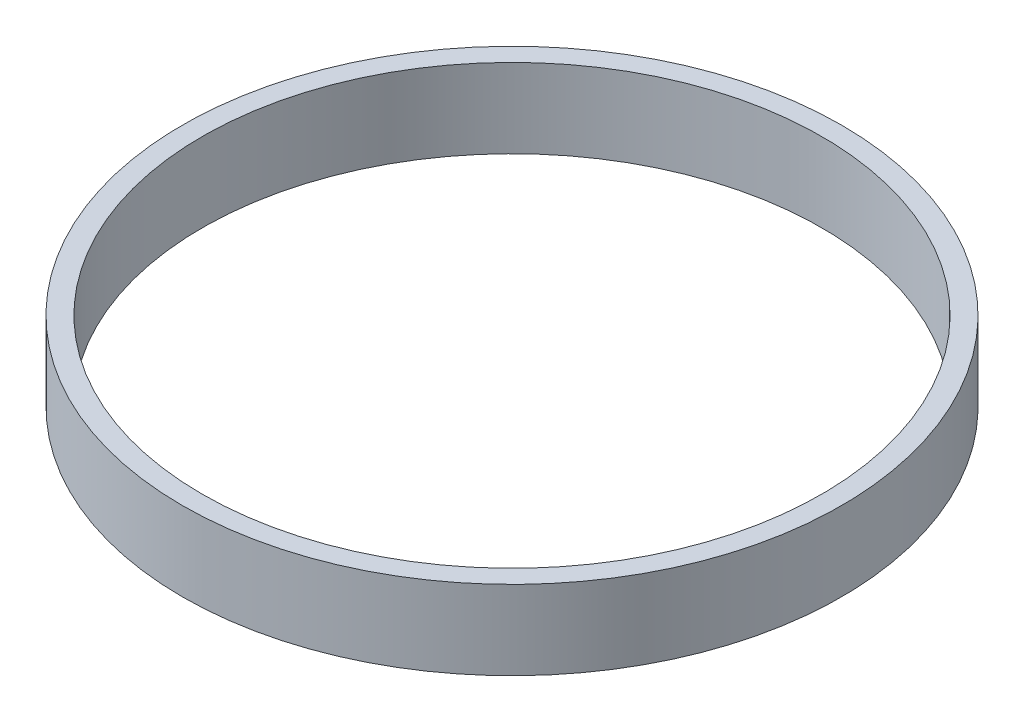
ISO-10303-21;
HEADER;
FILE_DESCRIPTION(('STEP AP214'),'2;1');
FILE_NAME('part.step','',(''),(''),'','','');
FILE_SCHEMA(('AUTOMOTIVE_DESIGN { 1 0 10303 214 1 1 1 1 }'));
ENDSEC;
DATA;
#1=APPLICATION_CONTEXT('core data for automotive mechanical design processes');
#2=APPLICATION_PROTOCOL_DEFINITION('international standard','automotive_design',2000,#1);
#3=PRODUCT_CONTEXT('',#1,'mechanical');
#4=PRODUCT('Part','Part','',(#3));
#5=PRODUCT_RELATED_PRODUCT_CATEGORY('part','',(#4));
#6=PRODUCT_DEFINITION_FORMATION('','',#4);
#7=PRODUCT_DEFINITION_CONTEXT('part definition',#1,'design');
#8=PRODUCT_DEFINITION('design','',#6,#7);
#9=PRODUCT_DEFINITION_SHAPE('','',#8);
#10=(LENGTH_UNIT() NAMED_UNIT(*) SI_UNIT(.MILLI.,.METRE.));
#11=(NAMED_UNIT(*) PLANE_ANGLE_UNIT() SI_UNIT($,.RADIAN.));
#12=(NAMED_UNIT(*) SI_UNIT($,.STERADIAN.) SOLID_ANGLE_UNIT());
#13=UNCERTAINTY_MEASURE_WITH_UNIT(LENGTH_MEASURE(1.E-05),#10,'distance_accuracy_value','');
#14=(GEOMETRIC_REPRESENTATION_CONTEXT(3) GLOBAL_UNCERTAINTY_ASSIGNED_CONTEXT((#13)) GLOBAL_UNIT_ASSIGNED_CONTEXT((#10,
#11,#12)) REPRESENTATION_CONTEXT('',''));
#15=CARTESIAN_POINT('',(0.,0.,0.));
#16=DIRECTION('',(0.,0.,1.));
#17=DIRECTION('',(1.,0.,0.));
#18=AXIS2_PLACEMENT_3D('',#15,#16,#17);
#19=CARTESIAN_POINT('',(0.,6.,0.));
#20=DIRECTION('',(0.,1.,0.));
#21=DIRECTION('',(0.,0.,1.));
#22=AXIS2_PLACEMENT_3D('',#19,#20,#21);
#23=PLANE('',#22);
#24=CARTESIAN_POINT('',(0.,6.,0.));
#25=DIRECTION('',(0.,1.,0.));
#26=DIRECTION('',(0.,0.,1.));
#27=AXIS2_PLACEMENT_3D('',#24,#25,#26);
#28=CIRCLE('',#27,25.);
#29=CARTESIAN_POINT('',(0.,6.,25.));
#30=VERTEX_POINT('',#29);
#31=EDGE_CURVE('E10',#30,#30,#28,.T.);
#32=ORIENTED_EDGE('',*,*,#31,.T.);
#33=EDGE_LOOP('',(#32));
#34=FACE_BOUND('',#33,.T.);
#35=CARTESIAN_POINT('',(0.,6.,0.));
#36=DIRECTION('',(0.,1.,0.));
#37=DIRECTION('',(0.,0.,1.));
#38=AXIS2_PLACEMENT_3D('',#35,#36,#37);
#39=CIRCLE('',#38,23.5);
#40=CARTESIAN_POINT('',(0.,6.,23.5));
#41=VERTEX_POINT('',#40);
#42=EDGE_CURVE('E50',#41,#41,#39,.T.);
#43=ORIENTED_EDGE('',*,*,#42,.F.);
#44=EDGE_LOOP('',(#43));
#45=FACE_BOUND('',#44,.T.);
#46=ADVANCED_FACE('F37',(#34,#45),#23,.T.);
#47=CARTESIAN_POINT('',(0.,0.,0.));
#48=DIRECTION('',(0.,1.,0.));
#49=DIRECTION('',(0.,0.,1.));
#50=AXIS2_PLACEMENT_3D('',#47,#48,#49);
#51=PLANE('',#50);
#52=CARTESIAN_POINT('',(0.,0.,0.));
#53=DIRECTION('',(0.,1.,0.));
#54=DIRECTION('',(0.,0.,1.));
#55=AXIS2_PLACEMENT_3D('',#52,#53,#54);
#56=CIRCLE('',#55,25.);
#57=CARTESIAN_POINT('',(0.,0.,25.));
#58=VERTEX_POINT('',#57);
#59=EDGE_CURVE('E41',#58,#58,#56,.T.);
#60=ORIENTED_EDGE('',*,*,#59,.F.);
#61=EDGE_LOOP('',(#60));
#62=FACE_BOUND('',#61,.T.);
#63=CARTESIAN_POINT('',(0.,0.,0.));
#64=DIRECTION('',(0.,1.,0.));
#65=DIRECTION('',(0.,0.,1.));
#66=AXIS2_PLACEMENT_3D('',#63,#64,#65);
#67=CIRCLE('',#66,23.5);
#68=CARTESIAN_POINT('',(0.,0.,23.5));
#69=VERTEX_POINT('',#68);
#70=EDGE_CURVE('E52',#69,#69,#67,.T.);
#71=ORIENTED_EDGE('',*,*,#70,.T.);
#72=EDGE_LOOP('',(#71));
#73=FACE_BOUND('',#72,.T.);
#74=ADVANCED_FACE('F64',(#62,#73),#51,.F.);
#75=CARTESIAN_POINT('',(0.,6.,0.));
#76=DIRECTION('',(0.,-1.,0.));
#77=DIRECTION('',(0.,0.,-1.));
#78=AXIS2_PLACEMENT_3D('',#75,#76,#77);
#79=CYLINDRICAL_SURFACE('',#78,25.);
#80=ORIENTED_EDGE('',*,*,#31,.F.);
#81=EDGE_LOOP('',(#80));
#82=FACE_BOUND('',#81,.T.);
#83=ORIENTED_EDGE('',*,*,#59,.T.);
#84=EDGE_LOOP('',(#83));
#85=FACE_BOUND('',#84,.T.);
#86=ADVANCED_FACE('F39',(#82,#85),#79,.T.);
#87=CARTESIAN_POINT('',(0.,6.,0.));
#88=DIRECTION('',(0.,-1.,0.));
#89=DIRECTION('',(0.,0.,-1.));
#90=AXIS2_PLACEMENT_3D('',#87,#88,#89);
#91=CYLINDRICAL_SURFACE('',#90,23.5);
#92=ORIENTED_EDGE('',*,*,#42,.T.);
#93=EDGE_LOOP('',(#92));
#94=FACE_BOUND('',#93,.T.);
#95=ORIENTED_EDGE('',*,*,#70,.F.);
#96=EDGE_LOOP('',(#95));
#97=FACE_BOUND('',#96,.T.);
#98=ADVANCED_FACE('F60',(#94,#97),#91,.F.);
#99=CLOSED_SHELL('',(#46,#74,#86,#98));
#100=MANIFOLD_SOLID_BREP('B2',#99);
#101=ADVANCED_BREP_SHAPE_REPRESENTATION('',(#18,#100),#14);
#102=SHAPE_DEFINITION_REPRESENTATION(#9,#101);
ENDSEC;
END-ISO-10303-21;
